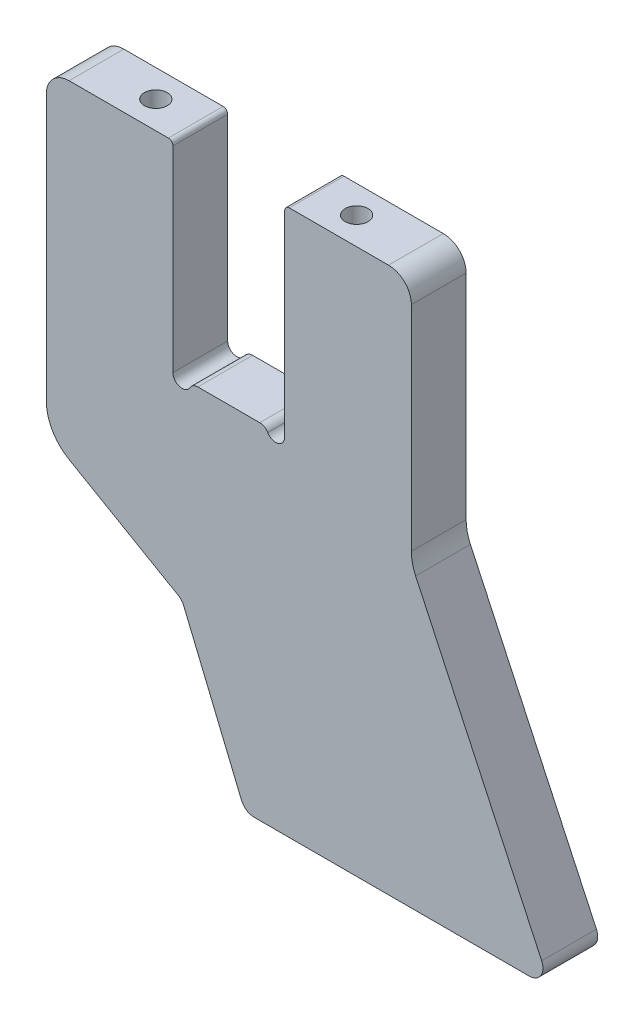
ISO-10303-21;
HEADER;
FILE_DESCRIPTION(('STEP AP214'),'2;1');
FILE_NAME('part.step','',(''),(''),'','','');
FILE_SCHEMA(('AUTOMOTIVE_DESIGN { 1 0 10303 214 1 1 1 1 }'));
ENDSEC;
DATA;
#1=APPLICATION_CONTEXT('core data for automotive mechanical design processes');
#2=APPLICATION_PROTOCOL_DEFINITION('international standard','automotive_design',2000,#1);
#3=PRODUCT_CONTEXT('',#1,'mechanical');
#4=PRODUCT('Part','Part','',(#3));
#5=PRODUCT_RELATED_PRODUCT_CATEGORY('part','',(#4));
#6=PRODUCT_DEFINITION_FORMATION('','',#4);
#7=PRODUCT_DEFINITION_CONTEXT('part definition',#1,'design');
#8=PRODUCT_DEFINITION('design','',#6,#7);
#9=PRODUCT_DEFINITION_SHAPE('','',#8);
#10=(LENGTH_UNIT() NAMED_UNIT(*) SI_UNIT(.MILLI.,.METRE.));
#11=(NAMED_UNIT(*) PLANE_ANGLE_UNIT() SI_UNIT($,.RADIAN.));
#12=(NAMED_UNIT(*) SI_UNIT($,.STERADIAN.) SOLID_ANGLE_UNIT());
#13=UNCERTAINTY_MEASURE_WITH_UNIT(LENGTH_MEASURE(1.E-05),#10,'distance_accuracy_value','');
#14=(GEOMETRIC_REPRESENTATION_CONTEXT(3) GLOBAL_UNCERTAINTY_ASSIGNED_CONTEXT((#13)) GLOBAL_UNIT_ASSIGNED_CONTEXT((#10,
#11,#12)) REPRESENTATION_CONTEXT('',''));
#15=CARTESIAN_POINT('',(0.,0.,0.));
#16=DIRECTION('',(0.,0.,1.));
#17=DIRECTION('',(1.,0.,0.));
#18=AXIS2_PLACEMENT_3D('',#15,#16,#17);
#19=CARTESIAN_POINT('',(35.,39.,12.));
#20=DIRECTION('',(0.,0.,-1.));
#21=DIRECTION('',(-1.,0.,0.));
#22=AXIS2_PLACEMENT_3D('',#19,#20,#21);
#23=CYLINDRICAL_SURFACE('',#22,5.);
#24=CARTESIAN_POINT('',(35.,39.,0.));
#25=DIRECTION('',(0.,0.,1.));
#26=DIRECTION('',(-1.,0.,0.));
#27=AXIS2_PLACEMENT_3D('',#24,#25,#26);
#28=CIRCLE('',#27,5.);
#29=CARTESIAN_POINT('',(40.,39.,0.));
#30=VERTEX_POINT('',#29);
#31=CARTESIAN_POINT('',(35.,44.,0.));
#32=VERTEX_POINT('',#31);
#33=EDGE_CURVE('E242',#30,#32,#28,.T.);
#34=ORIENTED_EDGE('',*,*,#33,.T.);
#35=DIRECTION('',(0.,0.,-1.));
#36=VECTOR('',#35,1.);
#37=CARTESIAN_POINT('',(35.,44.,12.));
#38=LINE('',#37,#36);
#39=CARTESIAN_POINT('',(35.,44.,12.));
#40=VERTEX_POINT('',#39);
#41=EDGE_CURVE('E11',#40,#32,#38,.T.);
#42=ORIENTED_EDGE('',*,*,#41,.F.);
#43=CARTESIAN_POINT('',(35.,39.,12.));
#44=DIRECTION('',(0.,0.,1.));
#45=DIRECTION('',(-1.,0.,0.));
#46=AXIS2_PLACEMENT_3D('',#43,#44,#45);
#47=CIRCLE('',#46,5.);
#48=CARTESIAN_POINT('',(40.,39.,12.));
#49=VERTEX_POINT('',#48);
#50=EDGE_CURVE('E289',#49,#40,#47,.T.);
#51=ORIENTED_EDGE('',*,*,#50,.F.);
#52=DIRECTION('',(0.,0.,-1.));
#53=VECTOR('',#52,1.);
#54=CARTESIAN_POINT('',(40.,39.,12.));
#55=LINE('',#54,#53);
#56=EDGE_CURVE('E238',#49,#30,#55,.T.);
#57=ORIENTED_EDGE('',*,*,#56,.T.);
#58=EDGE_LOOP('',(#34,#42,#51,#57));
#59=FACE_BOUND('',#58,.T.);
#60=ADVANCED_FACE('F47',(#59),#23,.T.);
#61=CARTESIAN_POINT('',(13.25,44.,12.));
#62=DIRECTION('',(0.,-1.,0.));
#63=DIRECTION('',(0.,0.,-1.));
#64=AXIS2_PLACEMENT_3D('',#61,#62,#63);
#65=PLANE('',#64);
#66=CARTESIAN_POINT('',(22.,44.,6.));
#67=DIRECTION('',(0.,1.,0.));
#68=DIRECTION('',(0.,0.,1.));
#69=AXIS2_PLACEMENT_3D('',#66,#67,#68);
#70=CIRCLE('',#69,2.5);
#71=CARTESIAN_POINT('',(22.,44.,8.5));
#72=VERTEX_POINT('',#71);
#73=EDGE_CURVE('E577',#72,#72,#70,.T.);
#74=ORIENTED_EDGE('',*,*,#73,.F.);
#75=EDGE_LOOP('',(#74));
#76=FACE_BOUND('',#75,.T.);
#77=DIRECTION('',(-1.,0.,0.));
#78=VECTOR('',#77,1.);
#79=CARTESIAN_POINT('',(13.25,44.,0.));
#80=LINE('',#79,#78);
#81=CARTESIAN_POINT('',(13.25,44.,0.));
#82=VERTEX_POINT('',#81);
#83=EDGE_CURVE('E245',#32,#82,#80,.T.);
#84=ORIENTED_EDGE('',*,*,#83,.T.);
#85=DIRECTION('',(0.,0.,-1.));
#86=VECTOR('',#85,1.);
#87=CARTESIAN_POINT('',(13.25,44.,12.));
#88=LINE('',#87,#86);
#89=CARTESIAN_POINT('',(13.25,44.,12.));
#90=VERTEX_POINT('',#89);
#91=EDGE_CURVE('E55',#90,#82,#88,.T.);
#92=ORIENTED_EDGE('',*,*,#91,.F.);
#93=DIRECTION('',(-1.,0.,0.));
#94=VECTOR('',#93,1.);
#95=CARTESIAN_POINT('',(13.25,44.,12.));
#96=LINE('',#95,#94);
#97=EDGE_CURVE('E155',#40,#90,#96,.T.);
#98=ORIENTED_EDGE('',*,*,#97,.F.);
#99=ORIENTED_EDGE('',*,*,#41,.T.);
#100=EDGE_LOOP('',(#84,#92,#98,#99));
#101=FACE_BOUND('',#100,.T.);
#102=ADVANCED_FACE('F427',(#76,#101),#65,.F.);
#103=CARTESIAN_POINT('',(13.25,43.,12.));
#104=DIRECTION('',(0.,0.,-1.));
#105=DIRECTION('',(-1.,0.,0.));
#106=AXIS2_PLACEMENT_3D('',#103,#104,#105);
#107=CYLINDRICAL_SURFACE('',#106,1.);
#108=CARTESIAN_POINT('',(13.25,43.,0.));
#109=DIRECTION('',(0.,0.,1.));
#110=DIRECTION('',(-1.,0.,0.));
#111=AXIS2_PLACEMENT_3D('',#108,#109,#110);
#112=CIRCLE('',#111,1.);
#113=CARTESIAN_POINT('',(12.25,43.,0.));
#114=VERTEX_POINT('',#113);
#115=EDGE_CURVE('E248',#82,#114,#112,.T.);
#116=ORIENTED_EDGE('',*,*,#115,.T.);
#117=DIRECTION('',(0.,0.,-1.));
#118=VECTOR('',#117,1.);
#119=CARTESIAN_POINT('',(12.25,43.,12.));
#120=LINE('',#119,#118);
#121=CARTESIAN_POINT('',(12.25,43.,12.));
#122=VERTEX_POINT('',#121);
#123=EDGE_CURVE('E344',#122,#114,#120,.T.);
#124=ORIENTED_EDGE('',*,*,#123,.F.);
#125=CARTESIAN_POINT('',(13.25,43.,12.));
#126=DIRECTION('',(0.,0.,1.));
#127=DIRECTION('',(-1.,0.,0.));
#128=AXIS2_PLACEMENT_3D('',#125,#126,#127);
#129=CIRCLE('',#128,1.);
#130=EDGE_CURVE('E352',#90,#122,#129,.T.);
#131=ORIENTED_EDGE('',*,*,#130,.F.);
#132=ORIENTED_EDGE('',*,*,#91,.T.);
#133=EDGE_LOOP('',(#116,#124,#131,#132));
#134=FACE_BOUND('',#133,.T.);
#135=ADVANCED_FACE('F350',(#134),#107,.T.);
#136=CARTESIAN_POINT('',(12.25,0.,12.));
#137=DIRECTION('',(1.,0.,0.));
#138=DIRECTION('',(0.,0.,-1.));
#139=AXIS2_PLACEMENT_3D('',#136,#137,#138);
#140=PLANE('',#139);
#141=DIRECTION('',(0.,-1.,0.));
#142=VECTOR('',#141,1.);
#143=CARTESIAN_POINT('',(12.25,0.,0.));
#144=LINE('',#143,#142);
#145=CARTESIAN_POINT('',(12.25,0.,0.));
#146=VERTEX_POINT('',#145);
#147=EDGE_CURVE('E250',#114,#146,#144,.T.);
#148=ORIENTED_EDGE('',*,*,#147,.T.);
#149=DIRECTION('',(0.,0.,-1.));
#150=VECTOR('',#149,1.);
#151=CARTESIAN_POINT('',(12.25,0.,12.));
#152=LINE('',#151,#150);
#153=CARTESIAN_POINT('',(12.25,0.,12.));
#154=VERTEX_POINT('',#153);
#155=EDGE_CURVE('E341',#154,#146,#152,.T.);
#156=ORIENTED_EDGE('',*,*,#155,.F.);
#157=DIRECTION('',(0.,-1.,0.));
#158=VECTOR('',#157,1.);
#159=CARTESIAN_POINT('',(12.25,0.,12.));
#160=LINE('',#159,#158);
#161=EDGE_CURVE('E370',#122,#154,#160,.T.);
#162=ORIENTED_EDGE('',*,*,#161,.F.);
#163=ORIENTED_EDGE('',*,*,#123,.T.);
#164=EDGE_LOOP('',(#148,#156,#162,#163));
#165=FACE_BOUND('',#164,.T.);
#166=ADVANCED_FACE('F361',(#165),#140,.F.);
#167=CARTESIAN_POINT('',(10.25,0.,12.));
#168=DIRECTION('',(0.,0.,-1.));
#169=DIRECTION('',(-1.,0.,0.));
#170=AXIS2_PLACEMENT_3D('',#167,#168,#169);
#171=CYLINDRICAL_SURFACE('',#170,2.);
#172=CARTESIAN_POINT('',(10.25,0.,0.));
#173=DIRECTION('',(0.,0.,-1.));
#174=DIRECTION('',(-1.,0.,0.));
#175=AXIS2_PLACEMENT_3D('',#172,#173,#174);
#176=CIRCLE('',#175,2.);
#177=CARTESIAN_POINT('',(8.51794919243112,-0.999999999999997,0.));
#178=VERTEX_POINT('',#177);
#179=EDGE_CURVE('E252',#146,#178,#176,.T.);
#180=ORIENTED_EDGE('',*,*,#179,.T.);
#181=DIRECTION('',(0.,0.,-1.));
#182=VECTOR('',#181,1.);
#183=CARTESIAN_POINT('',(8.51794919243112,-0.999999999999997,12.));
#184=LINE('',#183,#182);
#185=CARTESIAN_POINT('',(8.51794919243112,-0.999999999999997,12.));
#186=VERTEX_POINT('',#185);
#187=EDGE_CURVE('E338',#186,#178,#184,.T.);
#188=ORIENTED_EDGE('',*,*,#187,.F.);
#189=CARTESIAN_POINT('',(10.25,0.,12.));
#190=DIRECTION('',(0.,0.,-1.));
#191=DIRECTION('',(-1.,0.,0.));
#192=AXIS2_PLACEMENT_3D('',#189,#190,#191);
#193=CIRCLE('',#192,2.);
#194=EDGE_CURVE('E367',#154,#186,#193,.T.);
#195=ORIENTED_EDGE('',*,*,#194,.F.);
#196=ORIENTED_EDGE('',*,*,#155,.T.);
#197=EDGE_LOOP('',(#180,#188,#195,#196));
#198=FACE_BOUND('',#197,.T.);
#199=ADVANCED_FACE('F365',(#198),#171,.F.);
#200=CARTESIAN_POINT('',(6.78589838486225,-2.,12.));
#201=DIRECTION('',(0.,0.,-1.));
#202=DIRECTION('',(-1.,0.,0.));
#203=AXIS2_PLACEMENT_3D('',#200,#201,#202);
#204=CYLINDRICAL_SURFACE('',#203,2.);
#205=CARTESIAN_POINT('',(6.78589838486225,-2.,0.));
#206=DIRECTION('',(0.,0.,1.));
#207=DIRECTION('',(1.,0.,0.));
#208=AXIS2_PLACEMENT_3D('',#205,#206,#207);
#209=CIRCLE('',#208,2.);
#210=CARTESIAN_POINT('',(6.78589838486225,0.,0.));
#211=VERTEX_POINT('',#210);
#212=EDGE_CURVE('E254',#178,#211,#209,.T.);
#213=ORIENTED_EDGE('',*,*,#212,.T.);
#214=DIRECTION('',(0.,0.,-1.));
#215=VECTOR('',#214,1.);
#216=CARTESIAN_POINT('',(6.78589838486225,0.,12.));
#217=LINE('',#216,#215);
#218=CARTESIAN_POINT('',(6.78589838486225,0.,12.));
#219=VERTEX_POINT('',#218);
#220=EDGE_CURVE('E335',#219,#211,#217,.T.);
#221=ORIENTED_EDGE('',*,*,#220,.F.);
#222=CARTESIAN_POINT('',(6.78589838486225,-2.,12.));
#223=DIRECTION('',(0.,0.,1.));
#224=DIRECTION('',(1.,0.,0.));
#225=AXIS2_PLACEMENT_3D('',#222,#223,#224);
#226=CIRCLE('',#225,2.);
#227=EDGE_CURVE('E369',#186,#219,#226,.T.);
#228=ORIENTED_EDGE('',*,*,#227,.F.);
#229=ORIENTED_EDGE('',*,*,#187,.T.);
#230=EDGE_LOOP('',(#213,#221,#228,#229));
#231=FACE_BOUND('',#230,.T.);
#232=ADVANCED_FACE('F444',(#231),#204,.T.);
#233=CARTESIAN_POINT('',(-6.78589838486225,0.,12.));
#234=DIRECTION('',(0.,-1.,0.));
#235=DIRECTION('',(0.,0.,-1.));
#236=AXIS2_PLACEMENT_3D('',#233,#234,#235);
#237=PLANE('',#236);
#238=DIRECTION('',(-1.,0.,0.));
#239=VECTOR('',#238,1.);
#240=CARTESIAN_POINT('',(-6.78589838486225,0.,0.));
#241=LINE('',#240,#239);
#242=CARTESIAN_POINT('',(-6.78589838486225,0.,0.));
#243=VERTEX_POINT('',#242);
#244=EDGE_CURVE('E256',#211,#243,#241,.T.);
#245=ORIENTED_EDGE('',*,*,#244,.T.);
#246=DIRECTION('',(0.,0.,-1.));
#247=VECTOR('',#246,1.);
#248=CARTESIAN_POINT('',(-6.78589838486225,0.,12.));
#249=LINE('',#248,#247);
#250=CARTESIAN_POINT('',(-6.78589838486225,0.,12.));
#251=VERTEX_POINT('',#250);
#252=EDGE_CURVE('E332',#251,#243,#249,.T.);
#253=ORIENTED_EDGE('',*,*,#252,.F.);
#254=DIRECTION('',(-1.,0.,0.));
#255=VECTOR('',#254,1.);
#256=CARTESIAN_POINT('',(-6.78589838486225,0.,12.));
#257=LINE('',#256,#255);
#258=EDGE_CURVE('E372',#219,#251,#257,.T.);
#259=ORIENTED_EDGE('',*,*,#258,.F.);
#260=ORIENTED_EDGE('',*,*,#220,.T.);
#261=EDGE_LOOP('',(#245,#253,#259,#260));
#262=FACE_BOUND('',#261,.T.);
#263=ADVANCED_FACE('F447',(#262),#237,.F.);
#264=CARTESIAN_POINT('',(-6.78589838486225,-2.,12.));
#265=DIRECTION('',(0.,0.,-1.));
#266=DIRECTION('',(-1.,0.,0.));
#267=AXIS2_PLACEMENT_3D('',#264,#265,#266);
#268=CYLINDRICAL_SURFACE('',#267,2.);
#269=CARTESIAN_POINT('',(-6.78589838486225,-2.,0.));
#270=DIRECTION('',(0.,0.,1.));
#271=DIRECTION('',(-1.,0.,0.));
#272=AXIS2_PLACEMENT_3D('',#269,#270,#271);
#273=CIRCLE('',#272,2.);
#274=CARTESIAN_POINT('',(-8.51794919243112,-0.999999999999997,0.));
#275=VERTEX_POINT('',#274);
#276=EDGE_CURVE('E258',#243,#275,#273,.T.);
#277=ORIENTED_EDGE('',*,*,#276,.T.);
#278=DIRECTION('',(0.,0.,-1.));
#279=VECTOR('',#278,1.);
#280=CARTESIAN_POINT('',(-8.51794919243112,-0.999999999999997,12.));
#281=LINE('',#280,#279);
#282=CARTESIAN_POINT('',(-8.51794919243112,-0.999999999999997,12.));
#283=VERTEX_POINT('',#282);
#284=EDGE_CURVE('E329',#283,#275,#281,.T.);
#285=ORIENTED_EDGE('',*,*,#284,.F.);
#286=CARTESIAN_POINT('',(-6.78589838486225,-2.,12.));
#287=DIRECTION('',(0.,0.,1.));
#288=DIRECTION('',(-1.,0.,0.));
#289=AXIS2_PLACEMENT_3D('',#286,#287,#288);
#290=CIRCLE('',#289,2.);
#291=EDGE_CURVE('E378',#251,#283,#290,.T.);
#292=ORIENTED_EDGE('',*,*,#291,.F.);
#293=ORIENTED_EDGE('',*,*,#252,.T.);
#294=EDGE_LOOP('',(#277,#285,#292,#293));
#295=FACE_BOUND('',#294,.T.);
#296=ADVANCED_FACE('F451',(#295),#268,.T.);
#297=CARTESIAN_POINT('',(-10.25,0.,12.));
#298=DIRECTION('',(0.,0.,-1.));
#299=DIRECTION('',(-1.,0.,0.));
#300=AXIS2_PLACEMENT_3D('',#297,#298,#299);
#301=CYLINDRICAL_SURFACE('',#300,2.);
#302=CARTESIAN_POINT('',(-10.25,0.,0.));
#303=DIRECTION('',(0.,0.,-1.));
#304=DIRECTION('',(1.,0.,0.));
#305=AXIS2_PLACEMENT_3D('',#302,#303,#304);
#306=CIRCLE('',#305,2.);
#307=CARTESIAN_POINT('',(-12.25,0.,0.));
#308=VERTEX_POINT('',#307);
#309=EDGE_CURVE('E260',#275,#308,#306,.T.);
#310=ORIENTED_EDGE('',*,*,#309,.T.);
#311=DIRECTION('',(0.,0.,-1.));
#312=VECTOR('',#311,1.);
#313=CARTESIAN_POINT('',(-12.25,0.,12.));
#314=LINE('',#313,#312);
#315=CARTESIAN_POINT('',(-12.25,0.,12.));
#316=VERTEX_POINT('',#315);
#317=EDGE_CURVE('E326',#316,#308,#314,.T.);
#318=ORIENTED_EDGE('',*,*,#317,.F.);
#319=CARTESIAN_POINT('',(-10.25,0.,12.));
#320=DIRECTION('',(0.,0.,-1.));
#321=DIRECTION('',(1.,0.,0.));
#322=AXIS2_PLACEMENT_3D('',#319,#320,#321);
#323=CIRCLE('',#322,2.);
#324=EDGE_CURVE('E380',#283,#316,#323,.T.);
#325=ORIENTED_EDGE('',*,*,#324,.F.);
#326=ORIENTED_EDGE('',*,*,#284,.T.);
#327=EDGE_LOOP('',(#310,#318,#325,#326));
#328=FACE_BOUND('',#327,.T.);
#329=ADVANCED_FACE('F455',(#328),#301,.F.);
#330=CARTESIAN_POINT('',(-12.25,0.,12.));
#331=DIRECTION('',(-1.,0.,0.));
#332=DIRECTION('',(0.,0.,1.));
#333=AXIS2_PLACEMENT_3D('',#330,#331,#332);
#334=PLANE('',#333);
#335=DIRECTION('',(0.,1.,0.));
#336=VECTOR('',#335,1.);
#337=CARTESIAN_POINT('',(-12.25,0.,0.));
#338=LINE('',#337,#336);
#339=CARTESIAN_POINT('',(-12.25,43.,0.));
#340=VERTEX_POINT('',#339);
#341=EDGE_CURVE('E262',#308,#340,#338,.T.);
#342=ORIENTED_EDGE('',*,*,#341,.T.);
#343=DIRECTION('',(0.,0.,-1.));
#344=VECTOR('',#343,1.);
#345=CARTESIAN_POINT('',(-12.25,43.,12.));
#346=LINE('',#345,#344);
#347=CARTESIAN_POINT('',(-12.25,43.,12.));
#348=VERTEX_POINT('',#347);
#349=EDGE_CURVE('E323',#348,#340,#346,.T.);
#350=ORIENTED_EDGE('',*,*,#349,.F.);
#351=DIRECTION('',(0.,1.,0.));
#352=VECTOR('',#351,1.);
#353=CARTESIAN_POINT('',(-12.25,0.,12.));
#354=LINE('',#353,#352);
#355=EDGE_CURVE('E382',#316,#348,#354,.T.);
#356=ORIENTED_EDGE('',*,*,#355,.F.);
#357=ORIENTED_EDGE('',*,*,#317,.T.);
#358=EDGE_LOOP('',(#342,#350,#356,#357));
#359=FACE_BOUND('',#358,.T.);
#360=ADVANCED_FACE('F459',(#359),#334,.F.);
#361=CARTESIAN_POINT('',(-13.25,43.,12.));
#362=DIRECTION('',(0.,0.,-1.));
#363=DIRECTION('',(-1.,0.,0.));
#364=AXIS2_PLACEMENT_3D('',#361,#362,#363);
#365=CYLINDRICAL_SURFACE('',#364,1.);
#366=CARTESIAN_POINT('',(-13.25,43.,0.));
#367=DIRECTION('',(0.,0.,1.));
#368=DIRECTION('',(-1.,0.,0.));
#369=AXIS2_PLACEMENT_3D('',#366,#367,#368);
#370=CIRCLE('',#369,1.);
#371=CARTESIAN_POINT('',(-13.25,44.,0.));
#372=VERTEX_POINT('',#371);
#373=EDGE_CURVE('E264',#340,#372,#370,.T.);
#374=ORIENTED_EDGE('',*,*,#373,.T.);
#375=DIRECTION('',(0.,0.,-1.));
#376=VECTOR('',#375,1.);
#377=CARTESIAN_POINT('',(-13.25,44.,12.));
#378=LINE('',#377,#376);
#379=CARTESIAN_POINT('',(-13.25,44.,12.));
#380=VERTEX_POINT('',#379);
#381=EDGE_CURVE('E320',#380,#372,#378,.T.);
#382=ORIENTED_EDGE('',*,*,#381,.F.);
#383=CARTESIAN_POINT('',(-13.25,43.,12.));
#384=DIRECTION('',(0.,0.,1.));
#385=DIRECTION('',(-1.,0.,0.));
#386=AXIS2_PLACEMENT_3D('',#383,#384,#385);
#387=CIRCLE('',#386,1.);
#388=EDGE_CURVE('E384',#348,#380,#387,.T.);
#389=ORIENTED_EDGE('',*,*,#388,.F.);
#390=ORIENTED_EDGE('',*,*,#349,.T.);
#391=EDGE_LOOP('',(#374,#382,#389,#390));
#392=FACE_BOUND('',#391,.T.);
#393=ADVANCED_FACE('F463',(#392),#365,.T.);
#394=CARTESIAN_POINT('',(-13.25,44.,12.));
#395=DIRECTION('',(0.,-1.,0.));
#396=DIRECTION('',(0.,0.,-1.));
#397=AXIS2_PLACEMENT_3D('',#394,#395,#396);
#398=PLANE('',#397);
#399=CARTESIAN_POINT('',(-22.,44.,6.00000000000001));
#400=DIRECTION('',(0.,1.,0.));
#401=DIRECTION('',(0.,0.,1.));
#402=AXIS2_PLACEMENT_3D('',#399,#400,#401);
#403=CIRCLE('',#402,2.5);
#404=CARTESIAN_POINT('',(-22.,44.,8.50000000000001));
#405=VERTEX_POINT('',#404);
#406=EDGE_CURVE('E579',#405,#405,#403,.T.);
#407=ORIENTED_EDGE('',*,*,#406,.F.);
#408=EDGE_LOOP('',(#407));
#409=FACE_BOUND('',#408,.T.);
#410=DIRECTION('',(-1.,0.,0.));
#411=VECTOR('',#410,1.);
#412=CARTESIAN_POINT('',(-13.25,44.,0.));
#413=LINE('',#412,#411);
#414=CARTESIAN_POINT('',(-35.,44.,0.));
#415=VERTEX_POINT('',#414);
#416=EDGE_CURVE('E266',#372,#415,#413,.T.);
#417=ORIENTED_EDGE('',*,*,#416,.T.);
#418=DIRECTION('',(0.,0.,-1.));
#419=VECTOR('',#418,1.);
#420=CARTESIAN_POINT('',(-35.,44.,12.));
#421=LINE('',#420,#419);
#422=CARTESIAN_POINT('',(-35.,44.,12.));
#423=VERTEX_POINT('',#422);
#424=EDGE_CURVE('E317',#423,#415,#421,.T.);
#425=ORIENTED_EDGE('',*,*,#424,.F.);
#426=DIRECTION('',(-1.,0.,0.));
#427=VECTOR('',#426,1.);
#428=CARTESIAN_POINT('',(-13.25,44.,12.));
#429=LINE('',#428,#427);
#430=EDGE_CURVE('E386',#380,#423,#429,.T.);
#431=ORIENTED_EDGE('',*,*,#430,.F.);
#432=ORIENTED_EDGE('',*,*,#381,.T.);
#433=EDGE_LOOP('',(#417,#425,#431,#432));
#434=FACE_BOUND('',#433,.T.);
#435=ADVANCED_FACE('F467',(#409,#434),#398,.F.);
#436=CARTESIAN_POINT('',(-35.,39.,12.));
#437=DIRECTION('',(0.,0.,-1.));
#438=DIRECTION('',(-1.,0.,0.));
#439=AXIS2_PLACEMENT_3D('',#436,#437,#438);
#440=CYLINDRICAL_SURFACE('',#439,5.);
#441=CARTESIAN_POINT('',(-35.,39.,0.));
#442=DIRECTION('',(0.,0.,1.));
#443=DIRECTION('',(1.,0.,0.));
#444=AXIS2_PLACEMENT_3D('',#441,#442,#443);
#445=CIRCLE('',#444,5.);
#446=CARTESIAN_POINT('',(-40.,39.,0.));
#447=VERTEX_POINT('',#446);
#448=EDGE_CURVE('E268',#415,#447,#445,.T.);
#449=ORIENTED_EDGE('',*,*,#448,.T.);
#450=DIRECTION('',(0.,0.,-1.));
#451=VECTOR('',#450,1.);
#452=CARTESIAN_POINT('',(-40.,39.,12.));
#453=LINE('',#452,#451);
#454=CARTESIAN_POINT('',(-40.,39.,12.));
#455=VERTEX_POINT('',#454);
#456=EDGE_CURVE('E314',#455,#447,#453,.T.);
#457=ORIENTED_EDGE('',*,*,#456,.F.);
#458=CARTESIAN_POINT('',(-35.,39.,12.));
#459=DIRECTION('',(0.,0.,1.));
#460=DIRECTION('',(1.,0.,0.));
#461=AXIS2_PLACEMENT_3D('',#458,#459,#460);
#462=CIRCLE('',#461,5.);
#463=EDGE_CURVE('E388',#423,#455,#462,.T.);
#464=ORIENTED_EDGE('',*,*,#463,.F.);
#465=ORIENTED_EDGE('',*,*,#424,.T.);
#466=EDGE_LOOP('',(#449,#457,#464,#465));
#467=FACE_BOUND('',#466,.T.);
#468=ADVANCED_FACE('F470',(#467),#440,.T.);
#469=CARTESIAN_POINT('',(-40.,-19.2264973081037,12.));
#470=DIRECTION('',(1.,0.,0.));
#471=DIRECTION('',(0.,0.,-1.));
#472=AXIS2_PLACEMENT_3D('',#469,#470,#471);
#473=PLANE('',#472);
#474=DIRECTION('',(0.,-1.,0.));
#475=VECTOR('',#474,1.);
#476=CARTESIAN_POINT('',(-40.,-19.2264973081037,0.));
#477=LINE('',#476,#475);
#478=CARTESIAN_POINT('',(-40.,-19.2264973081037,0.));
#479=VERTEX_POINT('',#478);
#480=EDGE_CURVE('E270',#447,#479,#477,.T.);
#481=ORIENTED_EDGE('',*,*,#480,.T.);
#482=DIRECTION('',(0.,0.,-1.));
#483=VECTOR('',#482,1.);
#484=CARTESIAN_POINT('',(-40.,-19.2264973081037,12.));
#485=LINE('',#484,#483);
#486=CARTESIAN_POINT('',(-40.,-19.2264973081037,12.));
#487=VERTEX_POINT('',#486);
#488=EDGE_CURVE('E311',#487,#479,#485,.T.);
#489=ORIENTED_EDGE('',*,*,#488,.F.);
#490=DIRECTION('',(0.,-1.,0.));
#491=VECTOR('',#490,1.);
#492=CARTESIAN_POINT('',(-40.,-19.2264973081037,12.));
#493=LINE('',#492,#491);
#494=EDGE_CURVE('E390',#455,#487,#493,.T.);
#495=ORIENTED_EDGE('',*,*,#494,.F.);
#496=ORIENTED_EDGE('',*,*,#456,.T.);
#497=EDGE_LOOP('',(#481,#489,#495,#496));
#498=FACE_BOUND('',#497,.T.);
#499=ADVANCED_FACE('F474',(#498),#473,.F.);
#500=CARTESIAN_POINT('',(-30.,-19.2264973081037,12.));
#501=DIRECTION('',(0.,0.,-1.));
#502=DIRECTION('',(-1.,0.,0.));
#503=AXIS2_PLACEMENT_3D('',#500,#501,#502);
#504=CYLINDRICAL_SURFACE('',#503,9.99999999999999);
#505=CARTESIAN_POINT('',(-30.,-19.2264973081037,0.));
#506=DIRECTION('',(0.,0.,1.));
#507=DIRECTION('',(-1.,0.,0.));
#508=AXIS2_PLACEMENT_3D('',#505,#506,#507);
#509=CIRCLE('',#508,9.99999999999999);
#510=CARTESIAN_POINT('',(-35.,-27.8867513459481,0.));
#511=VERTEX_POINT('',#510);
#512=EDGE_CURVE('E272',#479,#511,#509,.T.);
#513=ORIENTED_EDGE('',*,*,#512,.T.);
#514=DIRECTION('',(0.,0.,-1.));
#515=VECTOR('',#514,1.);
#516=CARTESIAN_POINT('',(-35.,-27.8867513459481,12.));
#517=LINE('',#516,#515);
#518=CARTESIAN_POINT('',(-35.,-27.8867513459481,12.));
#519=VERTEX_POINT('',#518);
#520=EDGE_CURVE('E308',#519,#511,#517,.T.);
#521=ORIENTED_EDGE('',*,*,#520,.F.);
#522=CARTESIAN_POINT('',(-30.,-19.2264973081037,12.));
#523=DIRECTION('',(0.,0.,1.));
#524=DIRECTION('',(-1.,0.,0.));
#525=AXIS2_PLACEMENT_3D('',#522,#523,#524);
#526=CIRCLE('',#525,9.99999999999999);
#527=EDGE_CURVE('E392',#487,#519,#526,.T.);
#528=ORIENTED_EDGE('',*,*,#527,.F.);
#529=ORIENTED_EDGE('',*,*,#488,.T.);
#530=EDGE_LOOP('',(#513,#521,#528,#529));
#531=FACE_BOUND('',#530,.T.);
#532=ADVANCED_FACE('F478',(#531),#504,.T.);
#533=CARTESIAN_POINT('',(-11.1451112744061,-41.6593777731582,12.));
#534=DIRECTION('',(0.499999999999998,0.86602540378444,0.));
#535=DIRECTION('',(-0.86602540378444,0.499999999999998,0.));
#536=AXIS2_PLACEMENT_3D('',#533,#534,#535);
#537=PLANE('',#536);
#538=DIRECTION('',(0.86602540378444,-0.499999999999998,0.));
#539=VECTOR('',#538,1.);
#540=CARTESIAN_POINT('',(-11.1451112744061,-41.6593777731582,0.));
#541=LINE('',#540,#539);
#542=CARTESIAN_POINT('',(-11.1451112744061,-41.6593777731582,0.));
#543=VERTEX_POINT('',#542);
#544=EDGE_CURVE('E274',#511,#543,#541,.T.);
#545=ORIENTED_EDGE('',*,*,#544,.T.);
#546=DIRECTION('',(0.,0.,-1.));
#547=VECTOR('',#546,1.);
#548=CARTESIAN_POINT('',(-11.1451112744061,-41.6593777731582,12.));
#549=LINE('',#548,#547);
#550=CARTESIAN_POINT('',(-11.1451112744061,-41.6593777731582,12.));
#551=VERTEX_POINT('',#550);
#552=EDGE_CURVE('E305',#551,#543,#549,.T.);
#553=ORIENTED_EDGE('',*,*,#552,.F.);
#554=DIRECTION('',(0.86602540378444,-0.499999999999998,0.));
#555=VECTOR('',#554,1.);
#556=CARTESIAN_POINT('',(-11.1451112744061,-41.6593777731582,12.));
#557=LINE('',#556,#555);
#558=EDGE_CURVE('E394',#519,#551,#557,.T.);
#559=ORIENTED_EDGE('',*,*,#558,.F.);
#560=ORIENTED_EDGE('',*,*,#520,.T.);
#561=EDGE_LOOP('',(#545,#553,#559,#560));
#562=FACE_BOUND('',#561,.T.);
#563=ADVANCED_FACE('F482',(#562),#537,.F.);
#564=CARTESIAN_POINT('',(-12.6451112744061,-44.2574539845115,12.));
#565=DIRECTION('',(0.,0.,-1.));
#566=DIRECTION('',(-1.,0.,0.));
#567=AXIS2_PLACEMENT_3D('',#564,#565,#566);
#568=CYLINDRICAL_SURFACE('',#567,3.00000000000002);
#569=CARTESIAN_POINT('',(-12.6451112744061,-44.2574539845115,0.));
#570=DIRECTION('',(0.,0.,-1.));
#571=DIRECTION('',(1.,0.,0.));
#572=AXIS2_PLACEMENT_3D('',#569,#570,#571);
#573=CIRCLE('',#572,3.00000000000002);
#574=CARTESIAN_POINT('',(-9.87347267687225,-43.1094036874163,0.));
#575=VERTEX_POINT('',#574);
#576=EDGE_CURVE('E276',#543,#575,#573,.T.);
#577=ORIENTED_EDGE('',*,*,#576,.T.);
#578=DIRECTION('',(0.,0.,-1.));
#579=VECTOR('',#578,1.);
#580=CARTESIAN_POINT('',(-9.87347267687225,-43.1094036874163,12.));
#581=LINE('',#580,#579);
#582=CARTESIAN_POINT('',(-9.87347267687225,-43.1094036874163,12.));
#583=VERTEX_POINT('',#582);
#584=EDGE_CURVE('E302',#583,#575,#581,.T.);
#585=ORIENTED_EDGE('',*,*,#584,.F.);
#586=CARTESIAN_POINT('',(-12.6451112744061,-44.2574539845115,12.));
#587=DIRECTION('',(0.,0.,-1.));
#588=DIRECTION('',(1.,0.,0.));
#589=AXIS2_PLACEMENT_3D('',#586,#587,#588);
#590=CIRCLE('',#589,3.00000000000002);
#591=EDGE_CURVE('E396',#551,#583,#590,.T.);
#592=ORIENTED_EDGE('',*,*,#591,.F.);
#593=ORIENTED_EDGE('',*,*,#552,.T.);
#594=EDGE_LOOP('',(#577,#585,#592,#593));
#595=FACE_BOUND('',#594,.T.);
#596=ADVANCED_FACE('F486',(#595),#568,.F.);
#597=CARTESIAN_POINT('',(2.77604892537595,-73.6480502970953,12.));
#598=DIRECTION('',(0.923879532511287,0.38268343236509,0.));
#599=DIRECTION('',(-0.38268343236509,0.923879532511287,0.));
#600=AXIS2_PLACEMENT_3D('',#597,#598,#599);
#601=PLANE('',#600);
#602=DIRECTION('',(0.38268343236509,-0.923879532511287,0.));
#603=VECTOR('',#602,1.);
#604=CARTESIAN_POINT('',(2.77604892537595,-73.6480502970953,0.));
#605=LINE('',#604,#603);
#606=CARTESIAN_POINT('',(2.77604892537595,-73.6480502970953,0.));
#607=VERTEX_POINT('',#606);
#608=EDGE_CURVE('E278',#575,#607,#605,.T.);
#609=ORIENTED_EDGE('',*,*,#608,.T.);
#610=DIRECTION('',(0.,0.,-1.));
#611=VECTOR('',#610,1.);
#612=CARTESIAN_POINT('',(2.77604892537595,-73.6480502970953,12.));
#613=LINE('',#612,#611);
#614=CARTESIAN_POINT('',(2.77604892537595,-73.6480502970953,12.));
#615=VERTEX_POINT('',#614);
#616=EDGE_CURVE('E299',#615,#607,#613,.T.);
#617=ORIENTED_EDGE('',*,*,#616,.F.);
#618=DIRECTION('',(0.38268343236509,-0.923879532511287,0.));
#619=VECTOR('',#618,1.);
#620=CARTESIAN_POINT('',(2.77604892537595,-73.6480502970953,12.));
#621=LINE('',#620,#619);
#622=EDGE_CURVE('E398',#583,#615,#621,.T.);
#623=ORIENTED_EDGE('',*,*,#622,.F.);
#624=ORIENTED_EDGE('',*,*,#584,.T.);
#625=EDGE_LOOP('',(#609,#617,#623,#624));
#626=FACE_BOUND('',#625,.T.);
#627=ADVANCED_FACE('F490',(#626),#601,.F.);
#628=CARTESIAN_POINT('',(5.54768752290981,-72.5,12.));
#629=DIRECTION('',(0.,0.,-1.));
#630=DIRECTION('',(-1.,0.,0.));
#631=AXIS2_PLACEMENT_3D('',#628,#629,#630);
#632=CYLINDRICAL_SURFACE('',#631,3.);
#633=CARTESIAN_POINT('',(5.54768752290981,-72.5,0.));
#634=DIRECTION('',(0.,0.,1.));
#635=DIRECTION('',(-1.,0.,0.));
#636=AXIS2_PLACEMENT_3D('',#633,#634,#635);
#637=CIRCLE('',#636,3.);
#638=CARTESIAN_POINT('',(5.54768752290981,-75.5,0.));
#639=VERTEX_POINT('',#638);
#640=EDGE_CURVE('E280',#607,#639,#637,.T.);
#641=ORIENTED_EDGE('',*,*,#640,.T.);
#642=DIRECTION('',(0.,0.,-1.));
#643=VECTOR('',#642,1.);
#644=CARTESIAN_POINT('',(5.54768752290981,-75.5,12.));
#645=LINE('',#644,#643);
#646=CARTESIAN_POINT('',(5.54768752290981,-75.5,12.));
#647=VERTEX_POINT('',#646);
#648=EDGE_CURVE('E296',#647,#639,#645,.T.);
#649=ORIENTED_EDGE('',*,*,#648,.F.);
#650=CARTESIAN_POINT('',(5.54768752290981,-72.5,12.));
#651=DIRECTION('',(0.,0.,1.));
#652=DIRECTION('',(-1.,0.,0.));
#653=AXIS2_PLACEMENT_3D('',#650,#651,#652);
#654=CIRCLE('',#653,3.);
#655=EDGE_CURVE('E400',#615,#647,#654,.T.);
#656=ORIENTED_EDGE('',*,*,#655,.F.);
#657=ORIENTED_EDGE('',*,*,#616,.T.);
#658=EDGE_LOOP('',(#641,#649,#656,#657));
#659=FACE_BOUND('',#658,.T.);
#660=ADVANCED_FACE('F494',(#659),#632,.T.);
#661=CARTESIAN_POINT('',(65.8340948777995,-75.5,12.));
#662=DIRECTION('',(0.,1.,0.));
#663=DIRECTION('',(-1.,0.,0.));
#664=AXIS2_PLACEMENT_3D('',#661,#662,#663);
#665=PLANE('',#664);
#666=DIRECTION('',(1.,0.,0.));
#667=VECTOR('',#666,1.);
#668=CARTESIAN_POINT('',(65.8340948777995,-75.5,0.));
#669=LINE('',#668,#667);
#670=CARTESIAN_POINT('',(65.8340948777995,-75.5,0.));
#671=VERTEX_POINT('',#670);
#672=EDGE_CURVE('E282',#639,#671,#669,.T.);
#673=ORIENTED_EDGE('',*,*,#672,.T.);
#674=DIRECTION('',(0.,0.,-1.));
#675=VECTOR('',#674,1.);
#676=CARTESIAN_POINT('',(65.8340948777995,-75.5,12.));
#677=LINE('',#676,#675);
#678=CARTESIAN_POINT('',(65.8340948777995,-75.5,12.));
#679=VERTEX_POINT('',#678);
#680=EDGE_CURVE('E293',#679,#671,#677,.T.);
#681=ORIENTED_EDGE('',*,*,#680,.F.);
#682=DIRECTION('',(1.,0.,0.));
#683=VECTOR('',#682,1.);
#684=CARTESIAN_POINT('',(65.8340948777995,-75.5,12.));
#685=LINE('',#684,#683);
#686=EDGE_CURVE('E402',#647,#679,#685,.T.);
#687=ORIENTED_EDGE('',*,*,#686,.F.);
#688=ORIENTED_EDGE('',*,*,#648,.T.);
#689=EDGE_LOOP('',(#673,#681,#687,#688));
#690=FACE_BOUND('',#689,.T.);
#691=ADVANCED_FACE('F408',(#690),#665,.F.);
#692=CARTESIAN_POINT('',(65.8340948777995,-72.5,12.));
#693=DIRECTION('',(0.,0.,-1.));
#694=DIRECTION('',(-1.,0.,0.));
#695=AXIS2_PLACEMENT_3D('',#692,#693,#694);
#696=CYLINDRICAL_SURFACE('',#695,3.);
#697=CARTESIAN_POINT('',(65.8340948777995,-72.5,0.));
#698=DIRECTION('',(0.,0.,1.));
#699=DIRECTION('',(-1.,0.,0.));
#700=AXIS2_PLACEMENT_3D('',#697,#698,#699);
#701=CIRCLE('',#700,3.);
#702=CARTESIAN_POINT('',(68.5530182389094,-71.2321452147779,0.));
#703=VERTEX_POINT('',#702);
#704=EDGE_CURVE('E284',#671,#703,#701,.T.);
#705=ORIENTED_EDGE('',*,*,#704,.T.);
#706=DIRECTION('',(0.,0.,-1.));
#707=VECTOR('',#706,1.);
#708=CARTESIAN_POINT('',(68.5530182389094,-71.2321452147779,12.));
#709=LINE('',#708,#707);
#710=CARTESIAN_POINT('',(68.5530182389094,-71.2321452147779,12.));
#711=VERTEX_POINT('',#710);
#712=EDGE_CURVE('E233',#711,#703,#709,.T.);
#713=ORIENTED_EDGE('',*,*,#712,.F.);
#714=CARTESIAN_POINT('',(65.8340948777995,-72.5,12.));
#715=DIRECTION('',(0.,0.,1.));
#716=DIRECTION('',(-1.,0.,0.));
#717=AXIS2_PLACEMENT_3D('',#714,#715,#716);
#718=CIRCLE('',#717,3.);
#719=EDGE_CURVE('E224',#679,#711,#718,.T.);
#720=ORIENTED_EDGE('',*,*,#719,.F.);
#721=ORIENTED_EDGE('',*,*,#680,.T.);
#722=EDGE_LOOP('',(#705,#713,#720,#721));
#723=FACE_BOUND('',#722,.T.);
#724=ADVANCED_FACE('F412',(#723),#696,.T.);
#725=CARTESIAN_POINT('',(40.9369221296335,-12.0092359909776,12.));
#726=DIRECTION('',(-0.906307787036653,-0.422618261740694,0.));
#727=DIRECTION('',(0.422618261740694,-0.906307787036653,0.));
#728=AXIS2_PLACEMENT_3D('',#725,#726,#727);
#729=PLANE('',#728);
#730=DIRECTION('',(-0.422618261740694,0.906307787036653,0.));
#731=VECTOR('',#730,1.);
#732=CARTESIAN_POINT('',(40.9369221296335,-12.0092359909776,0.));
#733=LINE('',#732,#731);
#734=CARTESIAN_POINT('',(40.9369221296335,-12.0092359909776,0.));
#735=VERTEX_POINT('',#734);
#736=EDGE_CURVE('E232',#703,#735,#733,.T.);
#737=ORIENTED_EDGE('',*,*,#736,.T.);
#738=DIRECTION('',(0.,0.,-1.));
#739=VECTOR('',#738,1.);
#740=CARTESIAN_POINT('',(40.9369221296335,-12.0092359909776,12.));
#741=LINE('',#740,#739);
#742=CARTESIAN_POINT('',(40.9369221296335,-12.0092359909776,12.));
#743=VERTEX_POINT('',#742);
#744=EDGE_CURVE('E229',#743,#735,#741,.T.);
#745=ORIENTED_EDGE('',*,*,#744,.F.);
#746=DIRECTION('',(-0.422618261740694,0.906307787036653,0.));
#747=VECTOR('',#746,1.);
#748=CARTESIAN_POINT('',(40.9369221296335,-12.0092359909776,12.));
#749=LINE('',#748,#747);
#750=EDGE_CURVE('E218',#711,#743,#749,.T.);
#751=ORIENTED_EDGE('',*,*,#750,.F.);
#752=ORIENTED_EDGE('',*,*,#712,.T.);
#753=EDGE_LOOP('',(#737,#745,#751,#752));
#754=FACE_BOUND('',#753,.T.);
#755=ADVANCED_FACE('F230',(#754),#729,.F.);
#756=CARTESIAN_POINT('',(50.,-7.78305337357063,12.));
#757=DIRECTION('',(0.,0.,-1.));
#758=DIRECTION('',(-1.,0.,0.));
#759=AXIS2_PLACEMENT_3D('',#756,#757,#758);
#760=CYLINDRICAL_SURFACE('',#759,10.);
#761=CARTESIAN_POINT('',(50.,-7.78305337357063,0.));
#762=DIRECTION('',(0.,0.,-1.));
#763=DIRECTION('',(-1.,0.,0.));
#764=AXIS2_PLACEMENT_3D('',#761,#762,#763);
#765=CIRCLE('',#764,10.);
#766=CARTESIAN_POINT('',(40.,-7.78305337357063,0.));
#767=VERTEX_POINT('',#766);
#768=EDGE_CURVE('E141',#735,#767,#765,.T.);
#769=ORIENTED_EDGE('',*,*,#768,.T.);
#770=DIRECTION('',(0.,0.,-1.));
#771=VECTOR('',#770,1.);
#772=CARTESIAN_POINT('',(40.,-7.78305337357063,12.));
#773=LINE('',#772,#771);
#774=CARTESIAN_POINT('',(40.,-7.78305337357063,12.));
#775=VERTEX_POINT('',#774);
#776=EDGE_CURVE('E234',#775,#767,#773,.T.);
#777=ORIENTED_EDGE('',*,*,#776,.F.);
#778=CARTESIAN_POINT('',(50.,-7.78305337357063,12.));
#779=DIRECTION('',(0.,0.,-1.));
#780=DIRECTION('',(-1.,0.,0.));
#781=AXIS2_PLACEMENT_3D('',#778,#779,#780);
#782=CIRCLE('',#781,10.);
#783=EDGE_CURVE('E222',#743,#775,#782,.T.);
#784=ORIENTED_EDGE('',*,*,#783,.F.);
#785=ORIENTED_EDGE('',*,*,#744,.T.);
#786=EDGE_LOOP('',(#769,#777,#784,#785));
#787=FACE_BOUND('',#786,.T.);
#788=ADVANCED_FACE('F236',(#787),#760,.F.);
#789=CARTESIAN_POINT('',(40.,-7.78305337357063,12.));
#790=DIRECTION('',(-1.,0.,0.));
#791=DIRECTION('',(0.,-1.,0.));
#792=AXIS2_PLACEMENT_3D('',#789,#790,#791);
#793=PLANE('',#792);
#794=DIRECTION('',(0.,1.,0.));
#795=VECTOR('',#794,1.);
#796=CARTESIAN_POINT('',(40.,-7.78305337357063,0.));
#797=LINE('',#796,#795);
#798=EDGE_CURVE('E147',#767,#30,#797,.T.);
#799=ORIENTED_EDGE('',*,*,#798,.T.);
#800=ORIENTED_EDGE('',*,*,#56,.F.);
#801=DIRECTION('',(0.,1.,0.));
#802=VECTOR('',#801,1.);
#803=CARTESIAN_POINT('',(40.,-7.78305337357063,12.));
#804=LINE('',#803,#802);
#805=EDGE_CURVE('E63',#775,#49,#804,.T.);
#806=ORIENTED_EDGE('',*,*,#805,.F.);
#807=ORIENTED_EDGE('',*,*,#776,.T.);
#808=EDGE_LOOP('',(#799,#800,#806,#807));
#809=FACE_BOUND('',#808,.T.);
#810=ADVANCED_FACE('F416',(#809),#793,.F.);
#811=CARTESIAN_POINT('',(35.,39.,12.));
#812=DIRECTION('',(0.,0.,-1.));
#813=DIRECTION('',(-1.,0.,0.));
#814=AXIS2_PLACEMENT_3D('',#811,#812,#813);
#815=PLANE('',#814);
#816=ORIENTED_EDGE('',*,*,#50,.T.);
#817=ORIENTED_EDGE('',*,*,#97,.T.);
#818=ORIENTED_EDGE('',*,*,#130,.T.);
#819=ORIENTED_EDGE('',*,*,#161,.T.);
#820=ORIENTED_EDGE('',*,*,#194,.T.);
#821=ORIENTED_EDGE('',*,*,#227,.T.);
#822=ORIENTED_EDGE('',*,*,#258,.T.);
#823=ORIENTED_EDGE('',*,*,#291,.T.);
#824=ORIENTED_EDGE('',*,*,#324,.T.);
#825=ORIENTED_EDGE('',*,*,#355,.T.);
#826=ORIENTED_EDGE('',*,*,#388,.T.);
#827=ORIENTED_EDGE('',*,*,#430,.T.);
#828=ORIENTED_EDGE('',*,*,#463,.T.);
#829=ORIENTED_EDGE('',*,*,#494,.T.);
#830=ORIENTED_EDGE('',*,*,#527,.T.);
#831=ORIENTED_EDGE('',*,*,#558,.T.);
#832=ORIENTED_EDGE('',*,*,#591,.T.);
#833=ORIENTED_EDGE('',*,*,#622,.T.);
#834=ORIENTED_EDGE('',*,*,#655,.T.);
#835=ORIENTED_EDGE('',*,*,#686,.T.);
#836=ORIENTED_EDGE('',*,*,#719,.T.);
#837=ORIENTED_EDGE('',*,*,#750,.T.);
#838=ORIENTED_EDGE('',*,*,#783,.T.);
#839=ORIENTED_EDGE('',*,*,#805,.T.);
#840=EDGE_LOOP('',(#816,#817,#818,#819,#820,#821,#822,#823,#824,#825,#826,#827,#828,#829,#830,
#831,#832,#833,#834,#835,#836,#837,#838,#839));
#841=FACE_BOUND('',#840,.T.);
#842=ADVANCED_FACE('F220',(#841),#815,.F.);
#843=CARTESIAN_POINT('',(35.,39.,0.));
#844=DIRECTION('',(0.,0.,-1.));
#845=DIRECTION('',(-1.,0.,0.));
#846=AXIS2_PLACEMENT_3D('',#843,#844,#845);
#847=PLANE('',#846);
#848=ORIENTED_EDGE('',*,*,#33,.F.);
#849=ORIENTED_EDGE('',*,*,#798,.F.);
#850=ORIENTED_EDGE('',*,*,#768,.F.);
#851=ORIENTED_EDGE('',*,*,#736,.F.);
#852=ORIENTED_EDGE('',*,*,#704,.F.);
#853=ORIENTED_EDGE('',*,*,#672,.F.);
#854=ORIENTED_EDGE('',*,*,#640,.F.);
#855=ORIENTED_EDGE('',*,*,#608,.F.);
#856=ORIENTED_EDGE('',*,*,#576,.F.);
#857=ORIENTED_EDGE('',*,*,#544,.F.);
#858=ORIENTED_EDGE('',*,*,#512,.F.);
#859=ORIENTED_EDGE('',*,*,#480,.F.);
#860=ORIENTED_EDGE('',*,*,#448,.F.);
#861=ORIENTED_EDGE('',*,*,#416,.F.);
#862=ORIENTED_EDGE('',*,*,#373,.F.);
#863=ORIENTED_EDGE('',*,*,#341,.F.);
#864=ORIENTED_EDGE('',*,*,#309,.F.);
#865=ORIENTED_EDGE('',*,*,#276,.F.);
#866=ORIENTED_EDGE('',*,*,#244,.F.);
#867=ORIENTED_EDGE('',*,*,#212,.F.);
#868=ORIENTED_EDGE('',*,*,#179,.F.);
#869=ORIENTED_EDGE('',*,*,#147,.F.);
#870=ORIENTED_EDGE('',*,*,#115,.F.);
#871=ORIENTED_EDGE('',*,*,#83,.F.);
#872=EDGE_LOOP('',(#848,#849,#850,#851,#852,#853,#854,#855,#856,#857,#858,#859,#860,#861,#862,
#863,#864,#865,#866,#867,#868,#869,#870,#871));
#873=FACE_BOUND('',#872,.T.);
#874=ADVANCED_FACE('F356',(#873),#847,.T.);
#875=CARTESIAN_POINT('',(-22.,30.,6.00000000000001));
#876=DIRECTION('',(0.,1.,0.));
#877=DIRECTION('',(0.,0.,1.));
#878=AXIS2_PLACEMENT_3D('',#875,#876,#877);
#879=CONICAL_SURFACE('',#878,2.5,1.02974425867666);
#880=CARTESIAN_POINT('',(-22.,28.4978484524311,6.00000000000001));
#881=VERTEX_POINT('',#880);
#882=VERTEX_LOOP('',#881);
#883=FACE_BOUND('',#882,.T.);
#884=CARTESIAN_POINT('',(-22.,30.,6.00000000000001));
#885=DIRECTION('',(0.,1.,0.));
#886=DIRECTION('',(0.,0.,1.));
#887=AXIS2_PLACEMENT_3D('',#884,#885,#886);
#888=CIRCLE('',#887,2.5);
#889=CARTESIAN_POINT('',(-22.,30.,8.50000000000001));
#890=VERTEX_POINT('',#889);
#891=EDGE_CURVE('E246',#890,#890,#888,.T.);
#892=ORIENTED_EDGE('',*,*,#891,.T.);
#893=EDGE_LOOP('',(#892));
#894=FACE_BOUND('',#893,.T.);
#895=ADVANCED_FACE('F524',(#883,#894),#879,.F.);
#896=CARTESIAN_POINT('',(-22.,44.,6.00000000000001));
#897=DIRECTION('',(0.,1.,0.));
#898=DIRECTION('',(0.,0.,1.));
#899=AXIS2_PLACEMENT_3D('',#896,#897,#898);
#900=CYLINDRICAL_SURFACE('',#899,2.5);
#901=ORIENTED_EDGE('',*,*,#891,.F.);
#902=EDGE_LOOP('',(#901));
#903=FACE_BOUND('',#902,.T.);
#904=ORIENTED_EDGE('',*,*,#406,.T.);
#905=EDGE_LOOP('',(#904));
#906=FACE_BOUND('',#905,.T.);
#907=ADVANCED_FACE('F530',(#903,#906),#900,.F.);
#908=CARTESIAN_POINT('',(22.,30.,6.));
#909=DIRECTION('',(0.,1.,0.));
#910=DIRECTION('',(0.,0.,1.));
#911=AXIS2_PLACEMENT_3D('',#908,#909,#910);
#912=CONICAL_SURFACE('',#911,2.5,1.02974425867666);
#913=CARTESIAN_POINT('',(22.,28.4978484524311,6.));
#914=VERTEX_POINT('',#913);
#915=VERTEX_LOOP('',#914);
#916=FACE_BOUND('',#915,.T.);
#917=CARTESIAN_POINT('',(22.,30.,6.));
#918=DIRECTION('',(0.,1.,0.));
#919=DIRECTION('',(0.,0.,1.));
#920=AXIS2_PLACEMENT_3D('',#917,#918,#919);
#921=CIRCLE('',#920,2.5);
#922=CARTESIAN_POINT('',(22.,30.,8.5));
#923=VERTEX_POINT('',#922);
#924=EDGE_CURVE('E575',#923,#923,#921,.T.);
#925=ORIENTED_EDGE('',*,*,#924,.T.);
#926=EDGE_LOOP('',(#925));
#927=FACE_BOUND('',#926,.T.);
#928=ADVANCED_FACE('F539',(#916,#927),#912,.F.);
#929=CARTESIAN_POINT('',(22.,44.,6.));
#930=DIRECTION('',(0.,1.,0.));
#931=DIRECTION('',(0.,0.,1.));
#932=AXIS2_PLACEMENT_3D('',#929,#930,#931);
#933=CYLINDRICAL_SURFACE('',#932,2.5);
#934=ORIENTED_EDGE('',*,*,#924,.F.);
#935=EDGE_LOOP('',(#934));
#936=FACE_BOUND('',#935,.T.);
#937=ORIENTED_EDGE('',*,*,#73,.T.);
#938=EDGE_LOOP('',(#937));
#939=FACE_BOUND('',#938,.T.);
#940=ADVANCED_FACE('F548',(#936,#939),#933,.F.);
#941=CLOSED_SHELL('',(#60,#102,#135,#166,#199,#232,#263,#296,#329,#360,#393,#435,#468,#499,#532,
#563,#596,#627,#660,#691,#724,#755,#788,#810,#842,#874,#895,#907,#928,#940));
#942=MANIFOLD_SOLID_BREP('B2',#941);
#943=ADVANCED_BREP_SHAPE_REPRESENTATION('',(#18,#942),#14);
#944=SHAPE_DEFINITION_REPRESENTATION(#9,#943);
ENDSEC;
END-ISO-10303-21;
